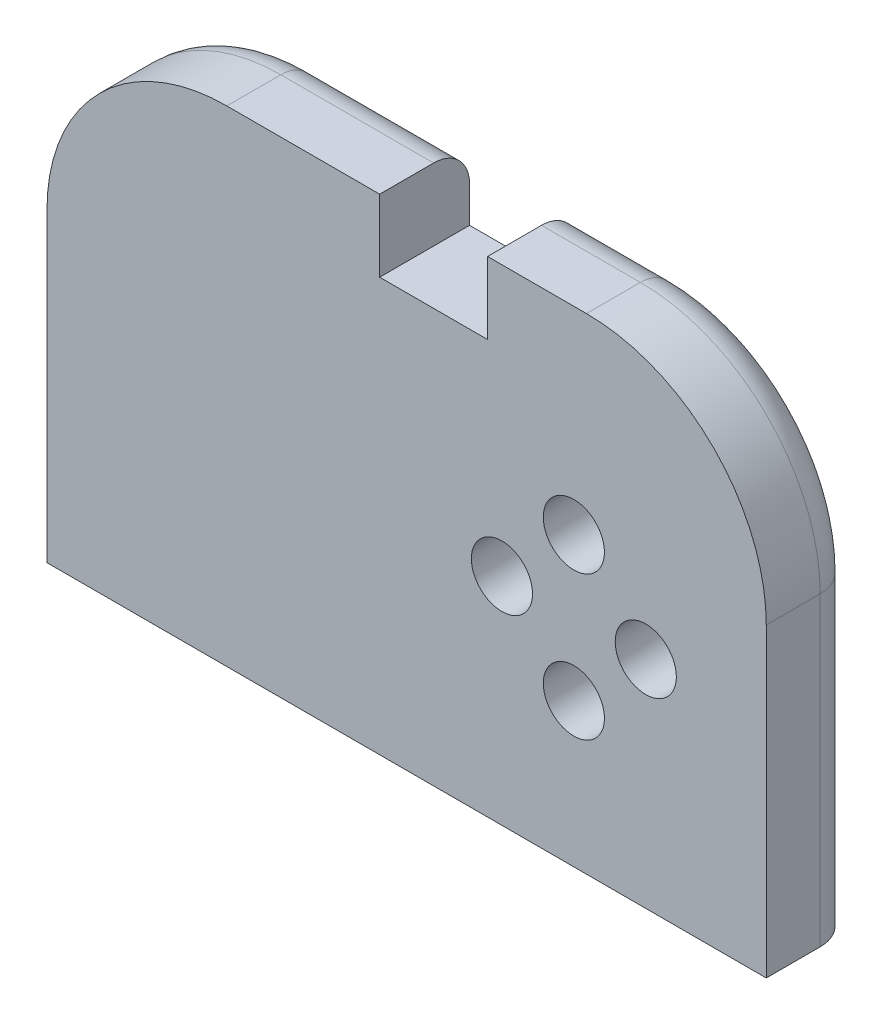
ISO-10303-21;
HEADER;
FILE_DESCRIPTION(('STEP AP214'),'2;1');
FILE_NAME('part.step','',(''),(''),'','','');
FILE_SCHEMA(('AUTOMOTIVE_DESIGN { 1 0 10303 214 1 1 1 1 }'));
ENDSEC;
DATA;
#1=APPLICATION_CONTEXT('core data for automotive mechanical design processes');
#2=APPLICATION_PROTOCOL_DEFINITION('international standard','automotive_design',2000,#1);
#3=PRODUCT_CONTEXT('',#1,'mechanical');
#4=PRODUCT('Part','Part','',(#3));
#5=PRODUCT_RELATED_PRODUCT_CATEGORY('part','',(#4));
#6=PRODUCT_DEFINITION_FORMATION('','',#4);
#7=PRODUCT_DEFINITION_CONTEXT('part definition',#1,'design');
#8=PRODUCT_DEFINITION('design','',#6,#7);
#9=PRODUCT_DEFINITION_SHAPE('','',#8);
#10=(LENGTH_UNIT() NAMED_UNIT(*) SI_UNIT(.MILLI.,.METRE.));
#11=(NAMED_UNIT(*) PLANE_ANGLE_UNIT() SI_UNIT($,.RADIAN.));
#12=(NAMED_UNIT(*) SI_UNIT($,.STERADIAN.) SOLID_ANGLE_UNIT());
#13=UNCERTAINTY_MEASURE_WITH_UNIT(LENGTH_MEASURE(1.E-05),#10,'distance_accuracy_value','');
#14=(GEOMETRIC_REPRESENTATION_CONTEXT(3) GLOBAL_UNCERTAINTY_ASSIGNED_CONTEXT((#13)) GLOBAL_UNIT_ASSIGNED_CONTEXT((#10,
#11,#12)) REPRESENTATION_CONTEXT('',''));
#15=CARTESIAN_POINT('',(0.,0.,0.));
#16=DIRECTION('',(0.,0.,1.));
#17=DIRECTION('',(1.,0.,0.));
#18=AXIS2_PLACEMENT_3D('',#15,#16,#17);
#19=CARTESIAN_POINT('',(20.,13.5,5.));
#20=DIRECTION('',(-1.,0.,0.));
#21=DIRECTION('',(0.,-1.,0.));
#22=AXIS2_PLACEMENT_3D('',#19,#20,#21);
#23=PLANE('',#22);
#24=DIRECTION('',(0.,0.,-1.));
#25=VECTOR('',#24,1.);
#26=CARTESIAN_POINT('',(20.,-13.5,5.));
#27=LINE('',#26,#25);
#28=CARTESIAN_POINT('',(20.,-13.5,5.));
#29=VERTEX_POINT('',#28);
#30=CARTESIAN_POINT('',(20.,-13.5,2.));
#31=VERTEX_POINT('',#30);
#32=EDGE_CURVE('E217',#29,#31,#27,.T.);
#33=ORIENTED_EDGE('',*,*,#32,.T.);
#34=DIRECTION('',(0.,1.,0.));
#35=VECTOR('',#34,1.);
#36=CARTESIAN_POINT('',(20.,13.5,2.));
#37=LINE('',#36,#35);
#38=CARTESIAN_POINT('',(20.,3.5,2.));
#39=VERTEX_POINT('',#38);
#40=EDGE_CURVE('E11',#31,#39,#37,.T.);
#41=ORIENTED_EDGE('',*,*,#40,.T.);
#42=DIRECTION('',(0.,0.,-1.));
#43=VECTOR('',#42,1.);
#44=CARTESIAN_POINT('',(20.,3.5,5.));
#45=LINE('',#44,#43);
#46=CARTESIAN_POINT('',(20.,3.5,5.));
#47=VERTEX_POINT('',#46);
#48=EDGE_CURVE('E269',#39,#47,#45,.F.);
#49=ORIENTED_EDGE('',*,*,#48,.T.);
#50=DIRECTION('',(0.,1.,0.));
#51=VECTOR('',#50,1.);
#52=CARTESIAN_POINT('',(20.,13.5,5.));
#53=LINE('',#52,#51);
#54=EDGE_CURVE('E190',#29,#47,#53,.T.);
#55=ORIENTED_EDGE('',*,*,#54,.F.);
#56=EDGE_LOOP('',(#33,#41,#49,#55));
#57=FACE_BOUND('',#56,.T.);
#58=ADVANCED_FACE('F43',(#57),#23,.F.);
#59=CARTESIAN_POINT('',(4.49999999999999,13.5,5.));
#60=DIRECTION('',(0.,-1.,0.));
#61=DIRECTION('',(0.,0.,-1.));
#62=AXIS2_PLACEMENT_3D('',#59,#60,#61);
#63=PLANE('',#62);
#64=DIRECTION('',(0.,0.,-1.));
#65=VECTOR('',#64,1.);
#66=CARTESIAN_POINT('',(9.99999999999999,13.5,5.));
#67=LINE('',#66,#65);
#68=CARTESIAN_POINT('',(9.99999999999999,13.5,5.));
#69=VERTEX_POINT('',#68);
#70=CARTESIAN_POINT('',(9.99999999999999,13.5,2.));
#71=VERTEX_POINT('',#70);
#72=EDGE_CURVE('E265',#69,#71,#67,.T.);
#73=ORIENTED_EDGE('',*,*,#72,.T.);
#74=DIRECTION('',(-1.,0.,0.));
#75=VECTOR('',#74,1.);
#76=CARTESIAN_POINT('',(4.49999999999999,13.5,2.));
#77=LINE('',#76,#75);
#78=CARTESIAN_POINT('',(4.49999999999999,13.5,2.));
#79=VERTEX_POINT('',#78);
#80=EDGE_CURVE('E303',#71,#79,#77,.T.);
#81=ORIENTED_EDGE('',*,*,#80,.T.);
#82=DIRECTION('',(0.,0.,-1.));
#83=VECTOR('',#82,1.);
#84=CARTESIAN_POINT('',(4.49999999999999,13.5,5.));
#85=LINE('',#84,#83);
#86=CARTESIAN_POINT('',(4.49999999999999,13.5,5.));
#87=VERTEX_POINT('',#86);
#88=EDGE_CURVE('E248',#87,#79,#85,.T.);
#89=ORIENTED_EDGE('',*,*,#88,.F.);
#90=DIRECTION('',(-1.,0.,0.));
#91=VECTOR('',#90,1.);
#92=CARTESIAN_POINT('',(4.49999999999999,13.5,5.));
#93=LINE('',#92,#91);
#94=EDGE_CURVE('E194',#69,#87,#93,.T.);
#95=ORIENTED_EDGE('',*,*,#94,.F.);
#96=EDGE_LOOP('',(#73,#81,#89,#95));
#97=FACE_BOUND('',#96,.T.);
#98=ADVANCED_FACE('F392',(#97),#63,.F.);
#99=CARTESIAN_POINT('',(4.49999999999999,9.5,5.));
#100=DIRECTION('',(1.,0.,0.));
#101=DIRECTION('',(0.,0.,-1.));
#102=AXIS2_PLACEMENT_3D('',#99,#100,#101);
#103=PLANE('',#102);
#104=ORIENTED_EDGE('',*,*,#88,.T.);
#105=CARTESIAN_POINT('',(4.49999999999999,11.5,2.));
#106=DIRECTION('',(1.,0.,0.));
#107=DIRECTION('',(0.,0.,-1.));
#108=AXIS2_PLACEMENT_3D('',#105,#106,#107);
#109=CIRCLE('',#108,2.);
#110=CARTESIAN_POINT('',(4.49999999999999,11.5,0.));
#111=VERTEX_POINT('',#110);
#112=EDGE_CURVE('E307',#79,#111,#109,.F.);
#113=ORIENTED_EDGE('',*,*,#112,.T.);
#114=DIRECTION('',(0.,-1.,0.));
#115=VECTOR('',#114,1.);
#116=CARTESIAN_POINT('',(4.49999999999999,9.5,0.));
#117=LINE('',#116,#115);
#118=CARTESIAN_POINT('',(4.49999999999999,9.5,0.));
#119=VERTEX_POINT('',#118);
#120=EDGE_CURVE('E218',#111,#119,#117,.T.);
#121=ORIENTED_EDGE('',*,*,#120,.T.);
#122=DIRECTION('',(0.,0.,-1.));
#123=VECTOR('',#122,1.);
#124=CARTESIAN_POINT('',(4.49999999999999,9.5,5.));
#125=LINE('',#124,#123);
#126=CARTESIAN_POINT('',(4.49999999999999,9.5,5.));
#127=VERTEX_POINT('',#126);
#128=EDGE_CURVE('E244',#127,#119,#125,.T.);
#129=ORIENTED_EDGE('',*,*,#128,.F.);
#130=DIRECTION('',(0.,-1.,0.));
#131=VECTOR('',#130,1.);
#132=CARTESIAN_POINT('',(4.49999999999999,9.5,5.));
#133=LINE('',#132,#131);
#134=EDGE_CURVE('E198',#87,#127,#133,.T.);
#135=ORIENTED_EDGE('',*,*,#134,.F.);
#136=EDGE_LOOP('',(#104,#113,#121,#129,#135));
#137=FACE_BOUND('',#136,.T.);
#138=ADVANCED_FACE('F388',(#137),#103,.F.);
#139=CARTESIAN_POINT('',(-1.50000000000001,9.5,5.));
#140=DIRECTION('',(0.,-1.,0.));
#141=DIRECTION('',(0.,0.,-1.));
#142=AXIS2_PLACEMENT_3D('',#139,#140,#141);
#143=PLANE('',#142);
#144=DIRECTION('',(-1.,0.,0.));
#145=VECTOR('',#144,1.);
#146=CARTESIAN_POINT('',(-1.50000000000001,9.5,0.));
#147=LINE('',#146,#145);
#148=CARTESIAN_POINT('',(-1.50000000000001,9.5,0.));
#149=VERTEX_POINT('',#148);
#150=EDGE_CURVE('E221',#119,#149,#147,.T.);
#151=ORIENTED_EDGE('',*,*,#150,.T.);
#152=DIRECTION('',(0.,0.,-1.));
#153=VECTOR('',#152,1.);
#154=CARTESIAN_POINT('',(-1.50000000000001,9.5,5.));
#155=LINE('',#154,#153);
#156=CARTESIAN_POINT('',(-1.50000000000001,9.5,5.));
#157=VERTEX_POINT('',#156);
#158=EDGE_CURVE('E240',#157,#149,#155,.T.);
#159=ORIENTED_EDGE('',*,*,#158,.F.);
#160=DIRECTION('',(-1.,0.,0.));
#161=VECTOR('',#160,1.);
#162=CARTESIAN_POINT('',(-1.50000000000001,9.5,5.));
#163=LINE('',#162,#161);
#164=EDGE_CURVE('E201',#127,#157,#163,.T.);
#165=ORIENTED_EDGE('',*,*,#164,.F.);
#166=ORIENTED_EDGE('',*,*,#128,.T.);
#167=EDGE_LOOP('',(#151,#159,#165,#166));
#168=FACE_BOUND('',#167,.T.);
#169=ADVANCED_FACE('F381',(#168),#143,.F.);
#170=CARTESIAN_POINT('',(-1.50000000000001,13.5,5.));
#171=DIRECTION('',(-1.,0.,0.));
#172=DIRECTION('',(0.,-1.,0.));
#173=AXIS2_PLACEMENT_3D('',#170,#171,#172);
#174=PLANE('',#173);
#175=DIRECTION('',(0.,1.,0.));
#176=VECTOR('',#175,1.);
#177=CARTESIAN_POINT('',(-1.50000000000001,13.5,0.));
#178=LINE('',#177,#176);
#179=CARTESIAN_POINT('',(-1.50000000000001,11.5,0.));
#180=VERTEX_POINT('',#179);
#181=EDGE_CURVE('E225',#149,#180,#178,.T.);
#182=ORIENTED_EDGE('',*,*,#181,.T.);
#183=CARTESIAN_POINT('',(-1.5,11.5,2.));
#184=DIRECTION('',(-1.,0.,0.));
#185=DIRECTION('',(0.,-1.,0.));
#186=AXIS2_PLACEMENT_3D('',#183,#184,#185);
#187=CIRCLE('',#186,2.);
#188=CARTESIAN_POINT('',(-1.50000000000001,13.5,2.));
#189=VERTEX_POINT('',#188);
#190=EDGE_CURVE('E53',#180,#189,#187,.F.);
#191=ORIENTED_EDGE('',*,*,#190,.T.);
#192=DIRECTION('',(0.,0.,-1.));
#193=VECTOR('',#192,1.);
#194=CARTESIAN_POINT('',(-1.50000000000001,13.5,5.));
#195=LINE('',#194,#193);
#196=CARTESIAN_POINT('',(-1.50000000000001,13.5,5.));
#197=VERTEX_POINT('',#196);
#198=EDGE_CURVE('E237',#197,#189,#195,.T.);
#199=ORIENTED_EDGE('',*,*,#198,.F.);
#200=DIRECTION('',(0.,1.,0.));
#201=VECTOR('',#200,1.);
#202=CARTESIAN_POINT('',(-1.50000000000001,13.5,5.));
#203=LINE('',#202,#201);
#204=EDGE_CURVE('E204',#157,#197,#203,.T.);
#205=ORIENTED_EDGE('',*,*,#204,.F.);
#206=ORIENTED_EDGE('',*,*,#158,.T.);
#207=EDGE_LOOP('',(#182,#191,#199,#205,#206));
#208=FACE_BOUND('',#207,.T.);
#209=ADVANCED_FACE('F379',(#208),#174,.F.);
#210=CARTESIAN_POINT('',(-20.,13.5,5.));
#211=DIRECTION('',(0.,-1.,0.));
#212=DIRECTION('',(0.,0.,-1.));
#213=AXIS2_PLACEMENT_3D('',#210,#211,#212);
#214=PLANE('',#213);
#215=ORIENTED_EDGE('',*,*,#198,.T.);
#216=DIRECTION('',(-1.,0.,0.));
#217=VECTOR('',#216,1.);
#218=CARTESIAN_POINT('',(-20.,13.5,2.));
#219=LINE('',#218,#217);
#220=CARTESIAN_POINT('',(-10.,13.5,2.));
#221=VERTEX_POINT('',#220);
#222=EDGE_CURVE('E313',#189,#221,#219,.T.);
#223=ORIENTED_EDGE('',*,*,#222,.T.);
#224=DIRECTION('',(0.,0.,-1.));
#225=VECTOR('',#224,1.);
#226=CARTESIAN_POINT('',(-10.,13.5,5.));
#227=LINE('',#226,#225);
#228=CARTESIAN_POINT('',(-10.,13.5,5.));
#229=VERTEX_POINT('',#228);
#230=EDGE_CURVE('E256',#221,#229,#227,.F.);
#231=ORIENTED_EDGE('',*,*,#230,.T.);
#232=DIRECTION('',(-1.,0.,0.));
#233=VECTOR('',#232,1.);
#234=CARTESIAN_POINT('',(-20.,13.5,5.));
#235=LINE('',#234,#233);
#236=EDGE_CURVE('E207',#197,#229,#235,.T.);
#237=ORIENTED_EDGE('',*,*,#236,.F.);
#238=EDGE_LOOP('',(#215,#223,#231,#237));
#239=FACE_BOUND('',#238,.T.);
#240=ADVANCED_FACE('F371',(#239),#214,.F.);
#241=CARTESIAN_POINT('',(-20.,13.5,5.));
#242=DIRECTION('',(1.,0.,0.));
#243=DIRECTION('',(0.,1.,0.));
#244=AXIS2_PLACEMENT_3D('',#241,#242,#243);
#245=PLANE('',#244);
#246=DIRECTION('',(0.,0.,-1.));
#247=VECTOR('',#246,1.);
#248=CARTESIAN_POINT('',(-20.,3.5,5.));
#249=LINE('',#248,#247);
#250=CARTESIAN_POINT('',(-20.,3.5,5.));
#251=VERTEX_POINT('',#250);
#252=CARTESIAN_POINT('',(-20.,3.5,2.));
#253=VERTEX_POINT('',#252);
#254=EDGE_CURVE('E252',#251,#253,#249,.T.);
#255=ORIENTED_EDGE('',*,*,#254,.T.);
#256=DIRECTION('',(0.,-1.,0.));
#257=VECTOR('',#256,1.);
#258=CARTESIAN_POINT('',(-20.,13.5,2.));
#259=LINE('',#258,#257);
#260=CARTESIAN_POINT('',(-20.,-13.5,2.));
#261=VERTEX_POINT('',#260);
#262=EDGE_CURVE('E272',#253,#261,#259,.T.);
#263=ORIENTED_EDGE('',*,*,#262,.T.);
#264=DIRECTION('',(0.,0.,-1.));
#265=VECTOR('',#264,1.);
#266=CARTESIAN_POINT('',(-20.,-13.5,5.));
#267=LINE('',#266,#265);
#268=CARTESIAN_POINT('',(-20.,-13.5,5.));
#269=VERTEX_POINT('',#268);
#270=EDGE_CURVE('E233',#269,#261,#267,.T.);
#271=ORIENTED_EDGE('',*,*,#270,.F.);
#272=DIRECTION('',(0.,-1.,0.));
#273=VECTOR('',#272,1.);
#274=CARTESIAN_POINT('',(-20.,13.5,5.));
#275=LINE('',#274,#273);
#276=EDGE_CURVE('E211',#251,#269,#275,.T.);
#277=ORIENTED_EDGE('',*,*,#276,.F.);
#278=EDGE_LOOP('',(#255,#263,#271,#277));
#279=FACE_BOUND('',#278,.T.);
#280=ADVANCED_FACE('F353',(#279),#245,.F.);
#281=CARTESIAN_POINT('',(-20.,-13.5,5.));
#282=DIRECTION('',(0.,1.,0.));
#283=DIRECTION('',(0.,0.,1.));
#284=AXIS2_PLACEMENT_3D('',#281,#282,#283);
#285=PLANE('',#284);
#286=CARTESIAN_POINT('',(-12.5,-13.5,3.));
#287=DIRECTION('',(0.,-1.,0.));
#288=DIRECTION('',(0.,0.,-1.));
#289=AXIS2_PLACEMENT_3D('',#286,#287,#288);
#290=CIRCLE('',#289,0.79999999999999);
#291=CARTESIAN_POINT('',(-12.5,-13.5,2.20000000000001));
#292=VERTEX_POINT('',#291);
#293=EDGE_CURVE('E166',#292,#292,#290,.T.);
#294=ORIENTED_EDGE('',*,*,#293,.F.);
#295=EDGE_LOOP('',(#294));
#296=FACE_BOUND('',#295,.T.);
#297=CARTESIAN_POINT('',(0.,-13.5,3.));
#298=DIRECTION('',(0.,-1.,0.));
#299=DIRECTION('',(0.,0.,-1.));
#300=AXIS2_PLACEMENT_3D('',#297,#298,#299);
#301=CIRCLE('',#300,0.79999999999999);
#302=CARTESIAN_POINT('',(0.,-13.5,2.20000000000001));
#303=VERTEX_POINT('',#302);
#304=EDGE_CURVE('E165',#303,#303,#301,.T.);
#305=ORIENTED_EDGE('',*,*,#304,.F.);
#306=EDGE_LOOP('',(#305));
#307=FACE_BOUND('',#306,.T.);
#308=CARTESIAN_POINT('',(12.5,-13.5,3.));
#309=DIRECTION('',(0.,-1.,0.));
#310=DIRECTION('',(0.,0.,-1.));
#311=AXIS2_PLACEMENT_3D('',#308,#309,#310);
#312=CIRCLE('',#311,0.79999999999999);
#313=CARTESIAN_POINT('',(12.5,-13.5,2.20000000000001));
#314=VERTEX_POINT('',#313);
#315=EDGE_CURVE('E181',#314,#314,#312,.T.);
#316=ORIENTED_EDGE('',*,*,#315,.F.);
#317=EDGE_LOOP('',(#316));
#318=FACE_BOUND('',#317,.T.);
#319=ORIENTED_EDGE('',*,*,#270,.T.);
#320=CARTESIAN_POINT('',(-18.,-13.5,2.));
#321=DIRECTION('',(0.,1.,0.));
#322=DIRECTION('',(0.,0.,1.));
#323=AXIS2_PLACEMENT_3D('',#320,#321,#322);
#324=CIRCLE('',#323,2.);
#325=CARTESIAN_POINT('',(-18.,-13.5,0.));
#326=VERTEX_POINT('',#325);
#327=EDGE_CURVE('E279',#261,#326,#324,.F.);
#328=ORIENTED_EDGE('',*,*,#327,.T.);
#329=DIRECTION('',(1.,0.,0.));
#330=VECTOR('',#329,1.);
#331=CARTESIAN_POINT('',(-20.,-13.5,0.));
#332=LINE('',#331,#330);
#333=CARTESIAN_POINT('',(18.,-13.5,0.));
#334=VERTEX_POINT('',#333);
#335=EDGE_CURVE('E195',#326,#334,#332,.T.);
#336=ORIENTED_EDGE('',*,*,#335,.T.);
#337=CARTESIAN_POINT('',(18.,-13.5,2.));
#338=DIRECTION('',(0.,1.,0.));
#339=DIRECTION('',(0.,0.,1.));
#340=AXIS2_PLACEMENT_3D('',#337,#338,#339);
#341=CIRCLE('',#340,2.);
#342=EDGE_CURVE('E276',#334,#31,#341,.F.);
#343=ORIENTED_EDGE('',*,*,#342,.T.);
#344=ORIENTED_EDGE('',*,*,#32,.F.);
#345=DIRECTION('',(1.,0.,0.));
#346=VECTOR('',#345,1.);
#347=CARTESIAN_POINT('',(-20.,-13.5,5.));
#348=LINE('',#347,#346);
#349=EDGE_CURVE('E214',#269,#29,#348,.T.);
#350=ORIENTED_EDGE('',*,*,#349,.F.);
#351=EDGE_LOOP('',(#319,#328,#336,#343,#344,#350));
#352=FACE_BOUND('',#351,.T.);
#353=ADVANCED_FACE('F345',(#296,#307,#318,#352),#285,.F.);
#354=CARTESIAN_POINT('',(0.,0.,5.));
#355=DIRECTION('',(0.,0.,1.));
#356=DIRECTION('',(1.,0.,0.));
#357=AXIS2_PLACEMENT_3D('',#354,#355,#356);
#358=PLANE('',#357);
#359=CARTESIAN_POINT('',(9.3,2.5,5.));
#360=DIRECTION('',(0.,0.,1.));
#361=DIRECTION('',(1.,0.,0.));
#362=AXIS2_PLACEMENT_3D('',#359,#360,#361);
#363=CIRCLE('',#362,1.7);
#364=CARTESIAN_POINT('',(11.,2.5,5.));
#365=VERTEX_POINT('',#364);
#366=EDGE_CURVE('E669',#365,#365,#363,.T.);
#367=ORIENTED_EDGE('',*,*,#366,.F.);
#368=EDGE_LOOP('',(#367));
#369=FACE_BOUND('',#368,.T.);
#370=CARTESIAN_POINT('',(5.3,-1.5,5.));
#371=DIRECTION('',(0.,0.,1.));
#372=DIRECTION('',(1.,0.,0.));
#373=AXIS2_PLACEMENT_3D('',#370,#371,#372);
#374=CIRCLE('',#373,1.7);
#375=CARTESIAN_POINT('',(7.,-1.5,5.));
#376=VERTEX_POINT('',#375);
#377=EDGE_CURVE('E682',#376,#376,#374,.T.);
#378=ORIENTED_EDGE('',*,*,#377,.F.);
#379=EDGE_LOOP('',(#378));
#380=FACE_BOUND('',#379,.T.);
#381=CARTESIAN_POINT('',(9.3,-5.5,5.));
#382=DIRECTION('',(0.,0.,1.));
#383=DIRECTION('',(1.,0.,0.));
#384=AXIS2_PLACEMENT_3D('',#381,#382,#383);
#385=CIRCLE('',#384,1.7);
#386=CARTESIAN_POINT('',(11.,-5.5,5.));
#387=VERTEX_POINT('',#386);
#388=EDGE_CURVE('E690',#387,#387,#385,.T.);
#389=ORIENTED_EDGE('',*,*,#388,.F.);
#390=EDGE_LOOP('',(#389));
#391=FACE_BOUND('',#390,.T.);
#392=CARTESIAN_POINT('',(13.3,-1.5,5.));
#393=DIRECTION('',(0.,0.,1.));
#394=DIRECTION('',(1.,0.,0.));
#395=AXIS2_PLACEMENT_3D('',#392,#393,#394);
#396=CIRCLE('',#395,1.7);
#397=CARTESIAN_POINT('',(15.,-1.5,5.));
#398=VERTEX_POINT('',#397);
#399=EDGE_CURVE('E174',#398,#398,#396,.T.);
#400=ORIENTED_EDGE('',*,*,#399,.F.);
#401=EDGE_LOOP('',(#400));
#402=FACE_BOUND('',#401,.T.);
#403=ORIENTED_EDGE('',*,*,#236,.T.);
#404=CARTESIAN_POINT('',(-10.,3.5,5.));
#405=DIRECTION('',(0.,0.,1.));
#406=DIRECTION('',(1.,0.,0.));
#407=AXIS2_PLACEMENT_3D('',#404,#405,#406);
#408=CIRCLE('',#407,10.);
#409=EDGE_CURVE('E262',#229,#251,#408,.T.);
#410=ORIENTED_EDGE('',*,*,#409,.T.);
#411=ORIENTED_EDGE('',*,*,#276,.T.);
#412=ORIENTED_EDGE('',*,*,#349,.T.);
#413=ORIENTED_EDGE('',*,*,#54,.T.);
#414=CARTESIAN_POINT('',(9.99999999999999,3.5,5.));
#415=DIRECTION('',(0.,0.,1.));
#416=DIRECTION('',(1.,0.,0.));
#417=AXIS2_PLACEMENT_3D('',#414,#415,#416);
#418=CIRCLE('',#417,10.);
#419=EDGE_CURVE('E259',#47,#69,#418,.T.);
#420=ORIENTED_EDGE('',*,*,#419,.T.);
#421=ORIENTED_EDGE('',*,*,#94,.T.);
#422=ORIENTED_EDGE('',*,*,#134,.T.);
#423=ORIENTED_EDGE('',*,*,#164,.T.);
#424=ORIENTED_EDGE('',*,*,#204,.T.);
#425=EDGE_LOOP('',(#403,#410,#411,#412,#413,#420,#421,#422,#423,#424));
#426=FACE_BOUND('',#425,.T.);
#427=ADVANCED_FACE('F375',(#369,#380,#391,#402,#426),#358,.T.);
#428=CARTESIAN_POINT('',(0.,0.,0.));
#429=DIRECTION('',(0.,0.,1.));
#430=DIRECTION('',(1.,0.,0.));
#431=AXIS2_PLACEMENT_3D('',#428,#429,#430);
#432=PLANE('',#431);
#433=CARTESIAN_POINT('',(9.3,2.5,0.));
#434=DIRECTION('',(0.,0.,-1.));
#435=DIRECTION('',(-1.,0.,0.));
#436=AXIS2_PLACEMENT_3D('',#433,#434,#435);
#437=CIRCLE('',#436,1.7);
#438=CARTESIAN_POINT('',(7.6,2.5,0.));
#439=VERTEX_POINT('',#438);
#440=EDGE_CURVE('E672',#439,#439,#437,.T.);
#441=ORIENTED_EDGE('',*,*,#440,.F.);
#442=EDGE_LOOP('',(#441));
#443=FACE_BOUND('',#442,.T.);
#444=CARTESIAN_POINT('',(5.3,-1.5,0.));
#445=DIRECTION('',(0.,0.,-1.));
#446=DIRECTION('',(-1.,0.,0.));
#447=AXIS2_PLACEMENT_3D('',#444,#445,#446);
#448=CIRCLE('',#447,1.7);
#449=CARTESIAN_POINT('',(3.6,-1.5,0.));
#450=VERTEX_POINT('',#449);
#451=EDGE_CURVE('E676',#450,#450,#448,.T.);
#452=ORIENTED_EDGE('',*,*,#451,.F.);
#453=EDGE_LOOP('',(#452));
#454=FACE_BOUND('',#453,.T.);
#455=CARTESIAN_POINT('',(9.3,-5.5,0.));
#456=DIRECTION('',(0.,0.,-1.));
#457=DIRECTION('',(-1.,0.,0.));
#458=AXIS2_PLACEMENT_3D('',#455,#456,#457);
#459=CIRCLE('',#458,1.7);
#460=CARTESIAN_POINT('',(7.6,-5.5,0.));
#461=VERTEX_POINT('',#460);
#462=EDGE_CURVE('E686',#461,#461,#459,.T.);
#463=ORIENTED_EDGE('',*,*,#462,.F.);
#464=EDGE_LOOP('',(#463));
#465=FACE_BOUND('',#464,.T.);
#466=CARTESIAN_POINT('',(13.3,-1.5,0.));
#467=DIRECTION('',(0.,0.,-1.));
#468=DIRECTION('',(-1.,0.,0.));
#469=AXIS2_PLACEMENT_3D('',#466,#467,#468);
#470=CIRCLE('',#469,1.7);
#471=CARTESIAN_POINT('',(11.6,-1.5,0.));
#472=VERTEX_POINT('',#471);
#473=EDGE_CURVE('E694',#472,#472,#470,.T.);
#474=ORIENTED_EDGE('',*,*,#473,.F.);
#475=EDGE_LOOP('',(#474));
#476=FACE_BOUND('',#475,.T.);
#477=ORIENTED_EDGE('',*,*,#335,.F.);
#478=DIRECTION('',(0.,-1.,0.));
#479=VECTOR('',#478,1.);
#480=CARTESIAN_POINT('',(-18.,0.,0.));
#481=LINE('',#480,#479);
#482=CARTESIAN_POINT('',(-18.,3.5,0.));
#483=VERTEX_POINT('',#482);
#484=EDGE_CURVE('E297',#326,#483,#481,.F.);
#485=ORIENTED_EDGE('',*,*,#484,.T.);
#486=CARTESIAN_POINT('',(-10.,3.5,0.));
#487=DIRECTION('',(0.,0.,1.));
#488=DIRECTION('',(1.,0.,0.));
#489=AXIS2_PLACEMENT_3D('',#486,#487,#488);
#490=CIRCLE('',#489,8.);
#491=CARTESIAN_POINT('',(-10.,11.5,0.));
#492=VERTEX_POINT('',#491);
#493=EDGE_CURVE('E294',#483,#492,#490,.F.);
#494=ORIENTED_EDGE('',*,*,#493,.T.);
#495=DIRECTION('',(-1.,0.,0.));
#496=VECTOR('',#495,1.);
#497=CARTESIAN_POINT('',(0.,11.5,0.));
#498=LINE('',#497,#496);
#499=EDGE_CURVE('E291',#492,#180,#498,.F.);
#500=ORIENTED_EDGE('',*,*,#499,.T.);
#501=ORIENTED_EDGE('',*,*,#181,.F.);
#502=ORIENTED_EDGE('',*,*,#150,.F.);
#503=ORIENTED_EDGE('',*,*,#120,.F.);
#504=DIRECTION('',(-1.,0.,0.));
#505=VECTOR('',#504,1.);
#506=CARTESIAN_POINT('',(0.,11.5,0.));
#507=LINE('',#506,#505);
#508=CARTESIAN_POINT('',(9.99999999999999,11.5,0.));
#509=VERTEX_POINT('',#508);
#510=EDGE_CURVE('E288',#111,#509,#507,.F.);
#511=ORIENTED_EDGE('',*,*,#510,.T.);
#512=CARTESIAN_POINT('',(9.99999999999999,3.5,0.));
#513=DIRECTION('',(0.,0.,1.));
#514=DIRECTION('',(1.,0.,0.));
#515=AXIS2_PLACEMENT_3D('',#512,#513,#514);
#516=CIRCLE('',#515,8.);
#517=CARTESIAN_POINT('',(18.,3.5,0.));
#518=VERTEX_POINT('',#517);
#519=EDGE_CURVE('E285',#509,#518,#516,.F.);
#520=ORIENTED_EDGE('',*,*,#519,.T.);
#521=DIRECTION('',(0.,1.,0.));
#522=VECTOR('',#521,1.);
#523=CARTESIAN_POINT('',(18.,0.,0.));
#524=LINE('',#523,#522);
#525=EDGE_CURVE('E282',#518,#334,#524,.F.);
#526=ORIENTED_EDGE('',*,*,#525,.T.);
#527=EDGE_LOOP('',(#477,#485,#494,#500,#501,#502,#503,#511,#520,#526));
#528=FACE_BOUND('',#527,.T.);
#529=ADVANCED_FACE('F342',(#443,#454,#465,#476,#528),#432,.F.);
#530=CARTESIAN_POINT('',(-10.,3.5,5.));
#531=DIRECTION('',(0.,0.,-1.));
#532=DIRECTION('',(-1.,0.,0.));
#533=AXIS2_PLACEMENT_3D('',#530,#531,#532);
#534=CYLINDRICAL_SURFACE('',#533,10.);
#535=ORIENTED_EDGE('',*,*,#230,.F.);
#536=CARTESIAN_POINT('',(-10.,3.5,2.));
#537=DIRECTION('',(0.,0.,1.));
#538=DIRECTION('',(1.,0.,0.));
#539=AXIS2_PLACEMENT_3D('',#536,#537,#538);
#540=CIRCLE('',#539,10.);
#541=EDGE_CURVE('E300',#221,#253,#540,.T.);
#542=ORIENTED_EDGE('',*,*,#541,.T.);
#543=ORIENTED_EDGE('',*,*,#254,.F.);
#544=ORIENTED_EDGE('',*,*,#409,.F.);
#545=EDGE_LOOP('',(#535,#542,#543,#544));
#546=FACE_BOUND('',#545,.T.);
#547=ADVANCED_FACE('F373',(#546),#534,.T.);
#548=CARTESIAN_POINT('',(9.99999999999999,3.5,5.));
#549=DIRECTION('',(0.,0.,-1.));
#550=DIRECTION('',(-1.,0.,0.));
#551=AXIS2_PLACEMENT_3D('',#548,#549,#550);
#552=CYLINDRICAL_SURFACE('',#551,10.);
#553=ORIENTED_EDGE('',*,*,#48,.F.);
#554=CARTESIAN_POINT('',(9.99999999999999,3.5,2.));
#555=DIRECTION('',(0.,0.,1.));
#556=DIRECTION('',(1.,0.,0.));
#557=AXIS2_PLACEMENT_3D('',#554,#555,#556);
#558=CIRCLE('',#557,10.);
#559=EDGE_CURVE('E310',#39,#71,#558,.T.);
#560=ORIENTED_EDGE('',*,*,#559,.T.);
#561=ORIENTED_EDGE('',*,*,#72,.F.);
#562=ORIENTED_EDGE('',*,*,#419,.F.);
#563=EDGE_LOOP('',(#553,#560,#561,#562));
#564=FACE_BOUND('',#563,.T.);
#565=ADVANCED_FACE('F403',(#564),#552,.T.);
#566=CARTESIAN_POINT('',(-20.,11.5,2.));
#567=DIRECTION('',(-1.,0.,0.));
#568=DIRECTION('',(0.,0.,1.));
#569=AXIS2_PLACEMENT_3D('',#566,#567,#568);
#570=CYLINDRICAL_SURFACE('',#569,2.);
#571=ORIENTED_EDGE('',*,*,#190,.F.);
#572=ORIENTED_EDGE('',*,*,#499,.F.);
#573=CARTESIAN_POINT('',(-10.,11.5,2.));
#574=DIRECTION('',(-1.,0.,0.));
#575=DIRECTION('',(0.,0.,1.));
#576=AXIS2_PLACEMENT_3D('',#573,#574,#575);
#577=CIRCLE('',#576,2.);
#578=EDGE_CURVE('E222',#221,#492,#577,.T.);
#579=ORIENTED_EDGE('',*,*,#578,.F.);
#580=ORIENTED_EDGE('',*,*,#222,.F.);
#581=EDGE_LOOP('',(#571,#572,#579,#580));
#582=FACE_BOUND('',#581,.T.);
#583=ADVANCED_FACE('F367',(#582),#570,.T.);
#584=CARTESIAN_POINT('',(-10.,3.5,2.));
#585=DIRECTION('',(0.,0.,1.));
#586=DIRECTION('',(1.,0.,0.));
#587=AXIS2_PLACEMENT_3D('',#584,#585,#586);
#588=TOROIDAL_SURFACE('',#587,8.,2.);
#589=ORIENTED_EDGE('',*,*,#578,.T.);
#590=ORIENTED_EDGE('',*,*,#493,.F.);
#591=CARTESIAN_POINT('',(-18.,3.5,2.));
#592=DIRECTION('',(0.,-1.,0.));
#593=DIRECTION('',(1.,0.,0.));
#594=AXIS2_PLACEMENT_3D('',#591,#592,#593);
#595=CIRCLE('',#594,2.);
#596=EDGE_CURVE('E318',#253,#483,#595,.T.);
#597=ORIENTED_EDGE('',*,*,#596,.F.);
#598=ORIENTED_EDGE('',*,*,#541,.F.);
#599=EDGE_LOOP('',(#589,#590,#597,#598));
#600=FACE_BOUND('',#599,.T.);
#601=ADVANCED_FACE('F362',(#600),#588,.T.);
#602=CARTESIAN_POINT('',(-18.,13.5,2.));
#603=DIRECTION('',(0.,-1.,0.));
#604=DIRECTION('',(1.,0.,0.));
#605=AXIS2_PLACEMENT_3D('',#602,#603,#604);
#606=CYLINDRICAL_SURFACE('',#605,2.);
#607=ORIENTED_EDGE('',*,*,#596,.T.);
#608=ORIENTED_EDGE('',*,*,#484,.F.);
#609=ORIENTED_EDGE('',*,*,#327,.F.);
#610=ORIENTED_EDGE('',*,*,#262,.F.);
#611=EDGE_LOOP('',(#607,#608,#609,#610));
#612=FACE_BOUND('',#611,.T.);
#613=ADVANCED_FACE('F351',(#612),#606,.T.);
#614=CARTESIAN_POINT('',(18.,13.5,2.));
#615=DIRECTION('',(0.,1.,0.));
#616=DIRECTION('',(-1.,0.,0.));
#617=AXIS2_PLACEMENT_3D('',#614,#615,#616);
#618=CYLINDRICAL_SURFACE('',#617,2.);
#619=ORIENTED_EDGE('',*,*,#342,.F.);
#620=ORIENTED_EDGE('',*,*,#525,.F.);
#621=CARTESIAN_POINT('',(18.,3.5,2.));
#622=DIRECTION('',(0.,1.,0.));
#623=DIRECTION('',(-1.,0.,0.));
#624=AXIS2_PLACEMENT_3D('',#621,#622,#623);
#625=CIRCLE('',#624,2.);
#626=EDGE_CURVE('E47',#39,#518,#625,.T.);
#627=ORIENTED_EDGE('',*,*,#626,.F.);
#628=ORIENTED_EDGE('',*,*,#40,.F.);
#629=EDGE_LOOP('',(#619,#620,#627,#628));
#630=FACE_BOUND('',#629,.T.);
#631=ADVANCED_FACE('F45',(#630),#618,.T.);
#632=CARTESIAN_POINT('',(9.99999999999999,3.5,2.));
#633=DIRECTION('',(0.,0.,1.));
#634=DIRECTION('',(1.,0.,0.));
#635=AXIS2_PLACEMENT_3D('',#632,#633,#634);
#636=TOROIDAL_SURFACE('',#635,8.,2.);
#637=ORIENTED_EDGE('',*,*,#626,.T.);
#638=ORIENTED_EDGE('',*,*,#519,.F.);
#639=CARTESIAN_POINT('',(9.99999999999999,11.5,2.));
#640=DIRECTION('',(-1.,0.,0.));
#641=DIRECTION('',(0.,0.,1.));
#642=AXIS2_PLACEMENT_3D('',#639,#640,#641);
#643=CIRCLE('',#642,2.);
#644=EDGE_CURVE('E189',#71,#509,#643,.T.);
#645=ORIENTED_EDGE('',*,*,#644,.F.);
#646=ORIENTED_EDGE('',*,*,#559,.F.);
#647=EDGE_LOOP('',(#637,#638,#645,#646));
#648=FACE_BOUND('',#647,.T.);
#649=ADVANCED_FACE('F336',(#648),#636,.T.);
#650=CARTESIAN_POINT('',(4.49999999999999,11.5,2.));
#651=DIRECTION('',(-1.,0.,0.));
#652=DIRECTION('',(0.,0.,1.));
#653=AXIS2_PLACEMENT_3D('',#650,#651,#652);
#654=CYLINDRICAL_SURFACE('',#653,2.);
#655=ORIENTED_EDGE('',*,*,#644,.T.);
#656=ORIENTED_EDGE('',*,*,#510,.F.);
#657=ORIENTED_EDGE('',*,*,#112,.F.);
#658=ORIENTED_EDGE('',*,*,#80,.F.);
#659=EDGE_LOOP('',(#655,#656,#657,#658));
#660=FACE_BOUND('',#659,.T.);
#661=ADVANCED_FACE('F413',(#660),#654,.T.);
#662=CARTESIAN_POINT('',(12.5,-9.5,3.));
#663=DIRECTION('',(0.,-1.,0.));
#664=DIRECTION('',(0.,0.,-1.));
#665=AXIS2_PLACEMENT_3D('',#662,#663,#664);
#666=CONICAL_SURFACE('',#665,0.799999999999999,1.02974425867665);
#667=CARTESIAN_POINT('',(12.5,-9.01931150477795,3.));
#668=VERTEX_POINT('',#667);
#669=VERTEX_LOOP('',#668);
#670=FACE_BOUND('',#669,.T.);
#671=CARTESIAN_POINT('',(12.5,-9.5,3.));
#672=DIRECTION('',(0.,-1.,0.));
#673=DIRECTION('',(0.,0.,-1.));
#674=AXIS2_PLACEMENT_3D('',#671,#672,#673);
#675=CIRCLE('',#674,0.799999999999999);
#676=CARTESIAN_POINT('',(12.5,-9.5,2.2));
#677=VERTEX_POINT('',#676);
#678=EDGE_CURVE('E185',#677,#677,#675,.T.);
#679=ORIENTED_EDGE('',*,*,#678,.T.);
#680=EDGE_LOOP('',(#679));
#681=FACE_BOUND('',#680,.T.);
#682=ADVANCED_FACE('F415',(#670,#681),#666,.F.);
#683=CARTESIAN_POINT('',(12.5,-13.5,3.));
#684=DIRECTION('',(0.,-1.,0.));
#685=DIRECTION('',(0.,0.,-1.));
#686=AXIS2_PLACEMENT_3D('',#683,#684,#685);
#687=CYLINDRICAL_SURFACE('',#686,0.799999999999994);
#688=ORIENTED_EDGE('',*,*,#678,.F.);
#689=EDGE_LOOP('',(#688));
#690=FACE_BOUND('',#689,.T.);
#691=ORIENTED_EDGE('',*,*,#315,.T.);
#692=EDGE_LOOP('',(#691));
#693=FACE_BOUND('',#692,.T.);
#694=ADVANCED_FACE('F558',(#690,#693),#687,.F.);
#695=CARTESIAN_POINT('',(0.,-9.5,3.));
#696=DIRECTION('',(0.,-1.,0.));
#697=DIRECTION('',(0.,0.,-1.));
#698=AXIS2_PLACEMENT_3D('',#695,#696,#697);
#699=CONICAL_SURFACE('',#698,0.799999999999999,1.02974425867665);
#700=CARTESIAN_POINT('',(0.,-9.01931150477795,3.));
#701=VERTEX_POINT('',#700);
#702=VERTEX_LOOP('',#701);
#703=FACE_BOUND('',#702,.T.);
#704=CARTESIAN_POINT('',(0.,-9.5,3.));
#705=DIRECTION('',(0.,-1.,0.));
#706=DIRECTION('',(0.,0.,-1.));
#707=AXIS2_PLACEMENT_3D('',#704,#705,#706);
#708=CIRCLE('',#707,0.799999999999999);
#709=CARTESIAN_POINT('',(0.,-9.5,2.2));
#710=VERTEX_POINT('',#709);
#711=EDGE_CURVE('E171',#710,#710,#708,.T.);
#712=ORIENTED_EDGE('',*,*,#711,.T.);
#713=EDGE_LOOP('',(#712));
#714=FACE_BOUND('',#713,.T.);
#715=ADVANCED_FACE('F567',(#703,#714),#699,.F.);
#716=CARTESIAN_POINT('',(0.,-13.5,3.));
#717=DIRECTION('',(0.,-1.,0.));
#718=DIRECTION('',(0.,0.,-1.));
#719=AXIS2_PLACEMENT_3D('',#716,#717,#718);
#720=CYLINDRICAL_SURFACE('',#719,0.799999999999994);
#721=ORIENTED_EDGE('',*,*,#711,.F.);
#722=EDGE_LOOP('',(#721));
#723=FACE_BOUND('',#722,.T.);
#724=ORIENTED_EDGE('',*,*,#304,.T.);
#725=EDGE_LOOP('',(#724));
#726=FACE_BOUND('',#725,.T.);
#727=ADVANCED_FACE('F158',(#723,#726),#720,.F.);
#728=CARTESIAN_POINT('',(-12.5,-9.5,3.));
#729=DIRECTION('',(0.,-1.,0.));
#730=DIRECTION('',(0.,0.,-1.));
#731=AXIS2_PLACEMENT_3D('',#728,#729,#730);
#732=CONICAL_SURFACE('',#731,0.799999999999999,1.02974425867665);
#733=CARTESIAN_POINT('',(-12.5,-9.01931150477795,3.));
#734=VERTEX_POINT('',#733);
#735=VERTEX_LOOP('',#734);
#736=FACE_BOUND('',#735,.T.);
#737=CARTESIAN_POINT('',(-12.5,-9.5,3.));
#738=DIRECTION('',(0.,-1.,0.));
#739=DIRECTION('',(0.,0.,-1.));
#740=AXIS2_PLACEMENT_3D('',#737,#738,#739);
#741=CIRCLE('',#740,0.799999999999999);
#742=CARTESIAN_POINT('',(-12.5,-9.5,2.2));
#743=VERTEX_POINT('',#742);
#744=EDGE_CURVE('E162',#743,#743,#741,.T.);
#745=ORIENTED_EDGE('',*,*,#744,.T.);
#746=EDGE_LOOP('',(#745));
#747=FACE_BOUND('',#746,.T.);
#748=ADVANCED_FACE('F154',(#736,#747),#732,.F.);
#749=CARTESIAN_POINT('',(-12.5,-13.5,3.));
#750=DIRECTION('',(0.,-1.,0.));
#751=DIRECTION('',(0.,0.,-1.));
#752=AXIS2_PLACEMENT_3D('',#749,#750,#751);
#753=CYLINDRICAL_SURFACE('',#752,0.799999999999994);
#754=ORIENTED_EDGE('',*,*,#744,.F.);
#755=EDGE_LOOP('',(#754));
#756=FACE_BOUND('',#755,.T.);
#757=ORIENTED_EDGE('',*,*,#293,.T.);
#758=EDGE_LOOP('',(#757));
#759=FACE_BOUND('',#758,.T.);
#760=ADVANCED_FACE('F157',(#756,#759),#753,.F.);
#761=CARTESIAN_POINT('',(13.3,-1.5,0.));
#762=DIRECTION('',(0.,0.,-1.));
#763=DIRECTION('',(-1.,0.,0.));
#764=AXIS2_PLACEMENT_3D('',#761,#762,#763);
#765=CYLINDRICAL_SURFACE('',#764,1.7);
#766=ORIENTED_EDGE('',*,*,#399,.T.);
#767=EDGE_LOOP('',(#766));
#768=FACE_BOUND('',#767,.T.);
#769=ORIENTED_EDGE('',*,*,#473,.T.);
#770=EDGE_LOOP('',(#769));
#771=FACE_BOUND('',#770,.T.);
#772=ADVANCED_FACE('F598',(#768,#771),#765,.F.);
#773=CARTESIAN_POINT('',(9.3,-5.5,0.));
#774=DIRECTION('',(0.,0.,-1.));
#775=DIRECTION('',(-1.,0.,0.));
#776=AXIS2_PLACEMENT_3D('',#773,#774,#775);
#777=CYLINDRICAL_SURFACE('',#776,1.7);
#778=ORIENTED_EDGE('',*,*,#388,.T.);
#779=EDGE_LOOP('',(#778));
#780=FACE_BOUND('',#779,.T.);
#781=ORIENTED_EDGE('',*,*,#462,.T.);
#782=EDGE_LOOP('',(#781));
#783=FACE_BOUND('',#782,.T.);
#784=ADVANCED_FACE('F606',(#780,#783),#777,.F.);
#785=CARTESIAN_POINT('',(5.3,-1.5,0.));
#786=DIRECTION('',(0.,0.,-1.));
#787=DIRECTION('',(-1.,0.,0.));
#788=AXIS2_PLACEMENT_3D('',#785,#786,#787);
#789=CYLINDRICAL_SURFACE('',#788,1.7);
#790=ORIENTED_EDGE('',*,*,#377,.T.);
#791=EDGE_LOOP('',(#790));
#792=FACE_BOUND('',#791,.T.);
#793=ORIENTED_EDGE('',*,*,#451,.T.);
#794=EDGE_LOOP('',(#793));
#795=FACE_BOUND('',#794,.T.);
#796=ADVANCED_FACE('F615',(#792,#795),#789,.F.);
#797=CARTESIAN_POINT('',(9.3,2.5,0.));
#798=DIRECTION('',(0.,0.,-1.));
#799=DIRECTION('',(-1.,0.,0.));
#800=AXIS2_PLACEMENT_3D('',#797,#798,#799);
#801=CYLINDRICAL_SURFACE('',#800,1.7);
#802=ORIENTED_EDGE('',*,*,#366,.T.);
#803=EDGE_LOOP('',(#802));
#804=FACE_BOUND('',#803,.T.);
#805=ORIENTED_EDGE('',*,*,#440,.T.);
#806=EDGE_LOOP('',(#805));
#807=FACE_BOUND('',#806,.T.);
#808=ADVANCED_FACE('F624',(#804,#807),#801,.F.);
#809=CLOSED_SHELL('',(#58,#98,#138,#169,#209,#240,#280,#353,#427,#529,#547,#565,#583,#601,#613,
#631,#649,#661,#682,#694,#715,#727,#748,#760,#772,#784,#796,#808));
#810=MANIFOLD_SOLID_BREP('B2',#809);
#811=ADVANCED_BREP_SHAPE_REPRESENTATION('',(#18,#810),#14);
#812=SHAPE_DEFINITION_REPRESENTATION(#9,#811);
ENDSEC;
END-ISO-10303-21;
